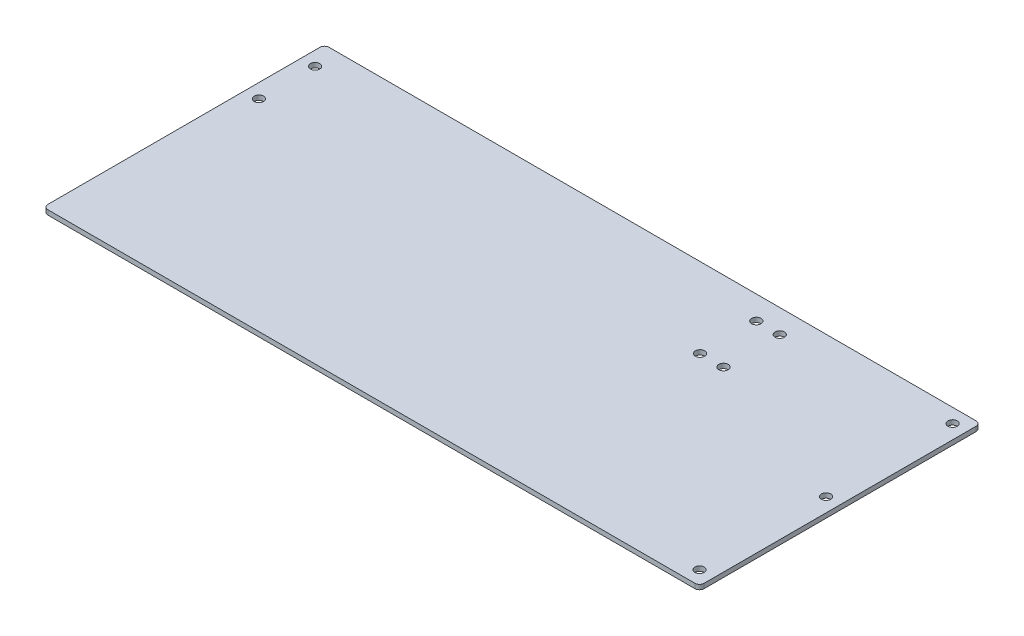
ISO-10303-21;
HEADER;
FILE_DESCRIPTION(('STEP AP214'),'2;1');
FILE_NAME('part.step','',(''),(''),'','','');
FILE_SCHEMA(('AUTOMOTIVE_DESIGN { 1 0 10303 214 1 1 1 1 }'));
ENDSEC;
DATA;
#1=APPLICATION_CONTEXT('core data for automotive mechanical design processes');
#2=APPLICATION_PROTOCOL_DEFINITION('international standard','automotive_design',2000,#1);
#3=PRODUCT_CONTEXT('',#1,'mechanical');
#4=PRODUCT('Part','Part','',(#3));
#5=PRODUCT_RELATED_PRODUCT_CATEGORY('part','',(#4));
#6=PRODUCT_DEFINITION_FORMATION('','',#4);
#7=PRODUCT_DEFINITION_CONTEXT('part definition',#1,'design');
#8=PRODUCT_DEFINITION('design','',#6,#7);
#9=PRODUCT_DEFINITION_SHAPE('','',#8);
#10=(LENGTH_UNIT() NAMED_UNIT(*) SI_UNIT(.MILLI.,.METRE.));
#11=(NAMED_UNIT(*) PLANE_ANGLE_UNIT() SI_UNIT($,.RADIAN.));
#12=(NAMED_UNIT(*) SI_UNIT($,.STERADIAN.) SOLID_ANGLE_UNIT());
#13=UNCERTAINTY_MEASURE_WITH_UNIT(LENGTH_MEASURE(1.E-05),#10,'distance_accuracy_value','');
#14=(GEOMETRIC_REPRESENTATION_CONTEXT(3) GLOBAL_UNCERTAINTY_ASSIGNED_CONTEXT((#13)) GLOBAL_UNIT_ASSIGNED_CONTEXT((#10,
#11,#12)) REPRESENTATION_CONTEXT('',''));
#15=CARTESIAN_POINT('',(0.,0.,0.));
#16=DIRECTION('',(0.,0.,1.));
#17=DIRECTION('',(1.,0.,0.));
#18=AXIS2_PLACEMENT_3D('',#15,#16,#17);
#19=CARTESIAN_POINT('',(222.25,3.175,-95.25));
#20=DIRECTION('',(-1.,0.,0.));
#21=DIRECTION('',(0.,0.,1.));
#22=AXIS2_PLACEMENT_3D('',#19,#20,#21);
#23=PLANE('',#22);
#24=DIRECTION('',(0.,0.,-1.));
#25=VECTOR('',#24,1.);
#26=CARTESIAN_POINT('',(222.25,0.,-95.25));
#27=LINE('',#26,#25);
#28=CARTESIAN_POINT('',(222.25,0.,92.075));
#29=VERTEX_POINT('',#28);
#30=CARTESIAN_POINT('',(222.25,0.,-92.075));
#31=VERTEX_POINT('',#30);
#32=EDGE_CURVE('E127',#29,#31,#27,.T.);
#33=ORIENTED_EDGE('',*,*,#32,.T.);
#34=DIRECTION('',(0.,-1.,0.));
#35=VECTOR('',#34,1.);
#36=CARTESIAN_POINT('',(222.25,3.175,-92.075));
#37=LINE('',#36,#35);
#38=CARTESIAN_POINT('',(222.25,3.175,-92.075));
#39=VERTEX_POINT('',#38);
#40=EDGE_CURVE('E105',#31,#39,#37,.F.);
#41=ORIENTED_EDGE('',*,*,#40,.T.);
#42=DIRECTION('',(0.,0.,-1.));
#43=VECTOR('',#42,1.);
#44=CARTESIAN_POINT('',(222.25,3.175,-95.25));
#45=LINE('',#44,#43);
#46=CARTESIAN_POINT('',(222.25,3.175,92.075));
#47=VERTEX_POINT('',#46);
#48=EDGE_CURVE('E137',#47,#39,#45,.T.);
#49=ORIENTED_EDGE('',*,*,#48,.F.);
#50=DIRECTION('',(0.,-1.,0.));
#51=VECTOR('',#50,1.);
#52=CARTESIAN_POINT('',(222.25,3.175,92.075));
#53=LINE('',#52,#51);
#54=EDGE_CURVE('E110',#47,#29,#53,.T.);
#55=ORIENTED_EDGE('',*,*,#54,.T.);
#56=EDGE_LOOP('',(#33,#41,#49,#55));
#57=FACE_BOUND('',#56,.T.);
#58=ADVANCED_FACE('F34',(#57),#23,.F.);
#59=CARTESIAN_POINT('',(-222.25,3.175,-95.25));
#60=DIRECTION('',(0.,0.,1.));
#61=DIRECTION('',(1.,0.,0.));
#62=AXIS2_PLACEMENT_3D('',#59,#60,#61);
#63=PLANE('',#62);
#64=DIRECTION('',(-1.,0.,0.));
#65=VECTOR('',#64,1.);
#66=CARTESIAN_POINT('',(-222.25,3.175,-95.25));
#67=LINE('',#66,#65);
#68=CARTESIAN_POINT('',(219.075,3.175,-95.25));
#69=VERTEX_POINT('',#68);
#70=CARTESIAN_POINT('',(-219.075,3.175,-95.25));
#71=VERTEX_POINT('',#70);
#72=EDGE_CURVE('E120',#69,#71,#67,.T.);
#73=ORIENTED_EDGE('',*,*,#72,.F.);
#74=DIRECTION('',(0.,-1.,0.));
#75=VECTOR('',#74,1.);
#76=CARTESIAN_POINT('',(219.075,3.175,-95.25));
#77=LINE('',#76,#75);
#78=CARTESIAN_POINT('',(219.075,0.,-95.25));
#79=VERTEX_POINT('',#78);
#80=EDGE_CURVE('E104',#69,#79,#77,.T.);
#81=ORIENTED_EDGE('',*,*,#80,.T.);
#82=DIRECTION('',(-1.,0.,0.));
#83=VECTOR('',#82,1.);
#84=CARTESIAN_POINT('',(-222.25,0.,-95.25));
#85=LINE('',#84,#83);
#86=CARTESIAN_POINT('',(-219.075,0.,-95.25));
#87=VERTEX_POINT('',#86);
#88=EDGE_CURVE('E117',#79,#87,#85,.T.);
#89=ORIENTED_EDGE('',*,*,#88,.T.);
#90=DIRECTION('',(0.,-1.,0.));
#91=VECTOR('',#90,1.);
#92=CARTESIAN_POINT('',(-219.075,3.175,-95.25));
#93=LINE('',#92,#91);
#94=EDGE_CURVE('E122',#87,#71,#93,.F.);
#95=ORIENTED_EDGE('',*,*,#94,.T.);
#96=EDGE_LOOP('',(#73,#81,#89,#95));
#97=FACE_BOUND('',#96,.T.);
#98=ADVANCED_FACE('F116',(#97),#63,.F.);
#99=CARTESIAN_POINT('',(-222.25,3.175,-95.25));
#100=DIRECTION('',(1.,0.,0.));
#101=DIRECTION('',(0.,0.,-1.));
#102=AXIS2_PLACEMENT_3D('',#99,#100,#101);
#103=PLANE('',#102);
#104=DIRECTION('',(0.,0.,1.));
#105=VECTOR('',#104,1.);
#106=CARTESIAN_POINT('',(-222.25,0.,-95.25));
#107=LINE('',#106,#105);
#108=CARTESIAN_POINT('',(-222.25,0.,-92.075));
#109=VERTEX_POINT('',#108);
#110=CARTESIAN_POINT('',(-222.25,0.,92.075));
#111=VERTEX_POINT('',#110);
#112=EDGE_CURVE('E126',#109,#111,#107,.T.);
#113=ORIENTED_EDGE('',*,*,#112,.T.);
#114=DIRECTION('',(0.,-1.,0.));
#115=VECTOR('',#114,1.);
#116=CARTESIAN_POINT('',(-222.25,3.175,92.075));
#117=LINE('',#116,#115);
#118=CARTESIAN_POINT('',(-222.25,3.175,92.075));
#119=VERTEX_POINT('',#118);
#120=EDGE_CURVE('E11',#111,#119,#117,.F.);
#121=ORIENTED_EDGE('',*,*,#120,.T.);
#122=DIRECTION('',(0.,0.,1.));
#123=VECTOR('',#122,1.);
#124=CARTESIAN_POINT('',(-222.25,3.175,-95.25));
#125=LINE('',#124,#123);
#126=CARTESIAN_POINT('',(-222.25,3.175,-92.075));
#127=VERTEX_POINT('',#126);
#128=EDGE_CURVE('E163',#127,#119,#125,.T.);
#129=ORIENTED_EDGE('',*,*,#128,.F.);
#130=DIRECTION('',(0.,-1.,0.));
#131=VECTOR('',#130,1.);
#132=CARTESIAN_POINT('',(-222.25,3.175,-92.075));
#133=LINE('',#132,#131);
#134=EDGE_CURVE('E42',#127,#109,#133,.T.);
#135=ORIENTED_EDGE('',*,*,#134,.T.);
#136=EDGE_LOOP('',(#113,#121,#129,#135));
#137=FACE_BOUND('',#136,.T.);
#138=ADVANCED_FACE('F161',(#137),#103,.F.);
#139=CARTESIAN_POINT('',(-222.25,3.175,95.25));
#140=DIRECTION('',(0.,0.,-1.));
#141=DIRECTION('',(-1.,0.,0.));
#142=AXIS2_PLACEMENT_3D('',#139,#140,#141);
#143=PLANE('',#142);
#144=DIRECTION('',(1.,0.,0.));
#145=VECTOR('',#144,1.);
#146=CARTESIAN_POINT('',(-222.25,0.,95.25));
#147=LINE('',#146,#145);
#148=CARTESIAN_POINT('',(-219.075,0.,95.25));
#149=VERTEX_POINT('',#148);
#150=CARTESIAN_POINT('',(219.075,0.,95.25));
#151=VERTEX_POINT('',#150);
#152=EDGE_CURVE('E130',#149,#151,#147,.T.);
#153=ORIENTED_EDGE('',*,*,#152,.T.);
#154=DIRECTION('',(0.,-1.,0.));
#155=VECTOR('',#154,1.);
#156=CARTESIAN_POINT('',(219.075,3.175,95.25));
#157=LINE('',#156,#155);
#158=CARTESIAN_POINT('',(219.075,3.175,95.25));
#159=VERTEX_POINT('',#158);
#160=EDGE_CURVE('E49',#151,#159,#157,.F.);
#161=ORIENTED_EDGE('',*,*,#160,.T.);
#162=DIRECTION('',(1.,0.,0.));
#163=VECTOR('',#162,1.);
#164=CARTESIAN_POINT('',(-222.25,3.175,95.25));
#165=LINE('',#164,#163);
#166=CARTESIAN_POINT('',(-219.075,3.175,95.25));
#167=VERTEX_POINT('',#166);
#168=EDGE_CURVE('E138',#167,#159,#165,.T.);
#169=ORIENTED_EDGE('',*,*,#168,.F.);
#170=DIRECTION('',(0.,-1.,0.));
#171=VECTOR('',#170,1.);
#172=CARTESIAN_POINT('',(-219.075,3.175,95.25));
#173=LINE('',#172,#171);
#174=EDGE_CURVE('E154',#167,#149,#173,.T.);
#175=ORIENTED_EDGE('',*,*,#174,.T.);
#176=EDGE_LOOP('',(#153,#161,#169,#175));
#177=FACE_BOUND('',#176,.T.);
#178=ADVANCED_FACE('F170',(#177),#143,.F.);
#179=CARTESIAN_POINT('',(0.,3.175,0.));
#180=DIRECTION('',(0.,1.,0.));
#181=DIRECTION('',(0.,0.,1.));
#182=AXIS2_PLACEMENT_3D('',#179,#180,#181);
#183=PLANE('',#182);
#184=CARTESIAN_POINT('',(212.725,3.175,-85.725));
#185=DIRECTION('',(0.,-1.,0.));
#186=DIRECTION('',(0.,0.,-1.));
#187=AXIS2_PLACEMENT_3D('',#184,#185,#186);
#188=CIRCLE('',#187,3.17500000000001);
#189=CARTESIAN_POINT('',(212.725,3.175,-88.9));
#190=VERTEX_POINT('',#189);
#191=EDGE_CURVE('E224',#190,#190,#188,.T.);
#192=ORIENTED_EDGE('',*,*,#191,.T.);
#193=EDGE_LOOP('',(#192));
#194=FACE_BOUND('',#193,.T.);
#195=CARTESIAN_POINT('',(212.725,3.175,0.));
#196=DIRECTION('',(0.,-1.,0.));
#197=DIRECTION('',(0.,0.,-1.));
#198=AXIS2_PLACEMENT_3D('',#195,#196,#197);
#199=CIRCLE('',#198,3.17500000000001);
#200=CARTESIAN_POINT('',(212.725,3.175,-3.17500000000001));
#201=VERTEX_POINT('',#200);
#202=EDGE_CURVE('E218',#201,#201,#199,.T.);
#203=ORIENTED_EDGE('',*,*,#202,.T.);
#204=EDGE_LOOP('',(#203));
#205=FACE_BOUND('',#204,.T.);
#206=CARTESIAN_POINT('',(212.725,3.175,85.725));
#207=DIRECTION('',(0.,-1.,0.));
#208=DIRECTION('',(0.,0.,-1.));
#209=AXIS2_PLACEMENT_3D('',#206,#207,#208);
#210=CIRCLE('',#209,3.17500000000001);
#211=CARTESIAN_POINT('',(212.725,3.175,82.55));
#212=VERTEX_POINT('',#211);
#213=EDGE_CURVE('E212',#212,#212,#210,.T.);
#214=ORIENTED_EDGE('',*,*,#213,.T.);
#215=EDGE_LOOP('',(#214));
#216=FACE_BOUND('',#215,.T.);
#217=CARTESIAN_POINT('',(-212.725,3.175,-79.375));
#218=DIRECTION('',(0.,1.,0.));
#219=DIRECTION('',(0.,0.,1.));
#220=AXIS2_PLACEMENT_3D('',#217,#218,#219);
#221=CIRCLE('',#220,3.17500000000001);
#222=CARTESIAN_POINT('',(-212.725,3.175,-76.2));
#223=VERTEX_POINT('',#222);
#224=EDGE_CURVE('E209',#223,#223,#221,.T.);
#225=ORIENTED_EDGE('',*,*,#224,.F.);
#226=EDGE_LOOP('',(#225));
#227=FACE_BOUND('',#226,.T.);
#228=CARTESIAN_POINT('',(-212.725,3.175,-41.275));
#229=DIRECTION('',(0.,1.,0.));
#230=DIRECTION('',(0.,0.,1.));
#231=AXIS2_PLACEMENT_3D('',#228,#229,#230);
#232=CIRCLE('',#231,3.17500000000001);
#233=CARTESIAN_POINT('',(-212.725,3.175,-38.1));
#234=VERTEX_POINT('',#233);
#235=EDGE_CURVE('E203',#234,#234,#232,.T.);
#236=ORIENTED_EDGE('',*,*,#235,.F.);
#237=EDGE_LOOP('',(#236));
#238=FACE_BOUND('',#237,.T.);
#239=CARTESIAN_POINT('',(101.981,3.175,-79.375));
#240=DIRECTION('',(0.,1.,0.));
#241=DIRECTION('',(0.,0.,1.));
#242=AXIS2_PLACEMENT_3D('',#239,#240,#241);
#243=CIRCLE('',#242,3.175);
#244=CARTESIAN_POINT('',(101.981,3.175,-76.2));
#245=VERTEX_POINT('',#244);
#246=EDGE_CURVE('E197',#245,#245,#243,.T.);
#247=ORIENTED_EDGE('',*,*,#246,.F.);
#248=EDGE_LOOP('',(#247));
#249=FACE_BOUND('',#248,.T.);
#250=CARTESIAN_POINT('',(101.981,3.175,-41.275));
#251=DIRECTION('',(0.,1.,0.));
#252=DIRECTION('',(0.,0.,1.));
#253=AXIS2_PLACEMENT_3D('',#250,#251,#252);
#254=CIRCLE('',#253,3.175);
#255=CARTESIAN_POINT('',(101.981,3.175,-38.1));
#256=VERTEX_POINT('',#255);
#257=EDGE_CURVE('E191',#256,#256,#254,.T.);
#258=ORIENTED_EDGE('',*,*,#257,.F.);
#259=EDGE_LOOP('',(#258));
#260=FACE_BOUND('',#259,.T.);
#261=CARTESIAN_POINT('',(86.106,3.175,-79.375));
#262=DIRECTION('',(0.,1.,0.));
#263=DIRECTION('',(0.,0.,1.));
#264=AXIS2_PLACEMENT_3D('',#261,#262,#263);
#265=CIRCLE('',#264,3.175);
#266=CARTESIAN_POINT('',(86.106,3.175,-76.2));
#267=VERTEX_POINT('',#266);
#268=EDGE_CURVE('E185',#267,#267,#265,.T.);
#269=ORIENTED_EDGE('',*,*,#268,.F.);
#270=EDGE_LOOP('',(#269));
#271=FACE_BOUND('',#270,.T.);
#272=CARTESIAN_POINT('',(86.106,3.175,-41.275));
#273=DIRECTION('',(0.,1.,0.));
#274=DIRECTION('',(0.,0.,1.));
#275=AXIS2_PLACEMENT_3D('',#272,#273,#274);
#276=CIRCLE('',#275,3.175);
#277=CARTESIAN_POINT('',(86.106,3.175,-38.1));
#278=VERTEX_POINT('',#277);
#279=EDGE_CURVE('E179',#278,#278,#276,.T.);
#280=ORIENTED_EDGE('',*,*,#279,.F.);
#281=EDGE_LOOP('',(#280));
#282=FACE_BOUND('',#281,.T.);
#283=ORIENTED_EDGE('',*,*,#48,.T.);
#284=CARTESIAN_POINT('',(219.075,3.175,-92.075));
#285=DIRECTION('',(0.,1.,0.));
#286=DIRECTION('',(0.,0.,1.));
#287=AXIS2_PLACEMENT_3D('',#284,#285,#286);
#288=CIRCLE('',#287,3.175);
#289=EDGE_CURVE('E152',#39,#69,#288,.T.);
#290=ORIENTED_EDGE('',*,*,#289,.T.);
#291=ORIENTED_EDGE('',*,*,#72,.T.);
#292=CARTESIAN_POINT('',(-219.075,3.175,-92.075));
#293=DIRECTION('',(0.,1.,0.));
#294=DIRECTION('',(0.,0.,1.));
#295=AXIS2_PLACEMENT_3D('',#292,#293,#294);
#296=CIRCLE('',#295,3.175);
#297=EDGE_CURVE('E147',#71,#127,#296,.T.);
#298=ORIENTED_EDGE('',*,*,#297,.T.);
#299=ORIENTED_EDGE('',*,*,#128,.T.);
#300=CARTESIAN_POINT('',(-219.075,3.175,92.075));
#301=DIRECTION('',(0.,1.,0.));
#302=DIRECTION('',(0.,0.,1.));
#303=AXIS2_PLACEMENT_3D('',#300,#301,#302);
#304=CIRCLE('',#303,3.175);
#305=EDGE_CURVE('E56',#119,#167,#304,.T.);
#306=ORIENTED_EDGE('',*,*,#305,.T.);
#307=ORIENTED_EDGE('',*,*,#168,.T.);
#308=CARTESIAN_POINT('',(219.075,3.175,92.075));
#309=DIRECTION('',(0.,1.,0.));
#310=DIRECTION('',(0.,0.,1.));
#311=AXIS2_PLACEMENT_3D('',#308,#309,#310);
#312=CIRCLE('',#311,3.175);
#313=EDGE_CURVE('E150',#159,#47,#312,.T.);
#314=ORIENTED_EDGE('',*,*,#313,.T.);
#315=EDGE_LOOP('',(#283,#290,#291,#298,#299,#306,#307,#314));
#316=FACE_BOUND('',#315,.T.);
#317=ADVANCED_FACE('F236',(#194,#205,#216,#227,#238,#249,#260,#271,#282,#316),#183,.T.);
#318=CARTESIAN_POINT('',(0.,0.,0.));
#319=DIRECTION('',(0.,1.,0.));
#320=DIRECTION('',(0.,0.,1.));
#321=AXIS2_PLACEMENT_3D('',#318,#319,#320);
#322=PLANE('',#321);
#323=CARTESIAN_POINT('',(212.725,0.,-85.725));
#324=DIRECTION('',(0.,-1.,0.));
#325=DIRECTION('',(0.,0.,-1.));
#326=AXIS2_PLACEMENT_3D('',#323,#324,#325);
#327=CIRCLE('',#326,3.17499999999998);
#328=CARTESIAN_POINT('',(212.725,0.,-88.9));
#329=VERTEX_POINT('',#328);
#330=EDGE_CURVE('E227',#329,#329,#327,.T.);
#331=ORIENTED_EDGE('',*,*,#330,.F.);
#332=EDGE_LOOP('',(#331));
#333=FACE_BOUND('',#332,.T.);
#334=CARTESIAN_POINT('',(212.725,0.,0.));
#335=DIRECTION('',(0.,-1.,0.));
#336=DIRECTION('',(0.,0.,-1.));
#337=AXIS2_PLACEMENT_3D('',#334,#335,#336);
#338=CIRCLE('',#337,3.17499999999998);
#339=CARTESIAN_POINT('',(212.725,0.,-3.17499999999998));
#340=VERTEX_POINT('',#339);
#341=EDGE_CURVE('E221',#340,#340,#338,.T.);
#342=ORIENTED_EDGE('',*,*,#341,.F.);
#343=EDGE_LOOP('',(#342));
#344=FACE_BOUND('',#343,.T.);
#345=CARTESIAN_POINT('',(212.725,0.,85.725));
#346=DIRECTION('',(0.,-1.,0.));
#347=DIRECTION('',(0.,0.,-1.));
#348=AXIS2_PLACEMENT_3D('',#345,#346,#347);
#349=CIRCLE('',#348,3.17499999999998);
#350=CARTESIAN_POINT('',(212.725,0.,82.55));
#351=VERTEX_POINT('',#350);
#352=EDGE_CURVE('E215',#351,#351,#349,.T.);
#353=ORIENTED_EDGE('',*,*,#352,.F.);
#354=EDGE_LOOP('',(#353));
#355=FACE_BOUND('',#354,.T.);
#356=CARTESIAN_POINT('',(-212.725,0.,-79.375));
#357=DIRECTION('',(0.,1.,0.));
#358=DIRECTION('',(0.,0.,1.));
#359=AXIS2_PLACEMENT_3D('',#356,#357,#358);
#360=CIRCLE('',#359,3.17500000000001);
#361=CARTESIAN_POINT('',(-212.725,0.,-76.2));
#362=VERTEX_POINT('',#361);
#363=EDGE_CURVE('E206',#362,#362,#360,.T.);
#364=ORIENTED_EDGE('',*,*,#363,.T.);
#365=EDGE_LOOP('',(#364));
#366=FACE_BOUND('',#365,.T.);
#367=CARTESIAN_POINT('',(-212.725,0.,-41.275));
#368=DIRECTION('',(0.,1.,0.));
#369=DIRECTION('',(0.,0.,1.));
#370=AXIS2_PLACEMENT_3D('',#367,#368,#369);
#371=CIRCLE('',#370,3.17500000000001);
#372=CARTESIAN_POINT('',(-212.725,0.,-38.1));
#373=VERTEX_POINT('',#372);
#374=EDGE_CURVE('E200',#373,#373,#371,.T.);
#375=ORIENTED_EDGE('',*,*,#374,.T.);
#376=EDGE_LOOP('',(#375));
#377=FACE_BOUND('',#376,.T.);
#378=CARTESIAN_POINT('',(101.981,0.,-79.375));
#379=DIRECTION('',(0.,1.,0.));
#380=DIRECTION('',(0.,0.,1.));
#381=AXIS2_PLACEMENT_3D('',#378,#379,#380);
#382=CIRCLE('',#381,3.175);
#383=CARTESIAN_POINT('',(101.981,0.,-76.2));
#384=VERTEX_POINT('',#383);
#385=EDGE_CURVE('E194',#384,#384,#382,.T.);
#386=ORIENTED_EDGE('',*,*,#385,.T.);
#387=EDGE_LOOP('',(#386));
#388=FACE_BOUND('',#387,.T.);
#389=CARTESIAN_POINT('',(101.981,0.,-41.275));
#390=DIRECTION('',(0.,1.,0.));
#391=DIRECTION('',(0.,0.,1.));
#392=AXIS2_PLACEMENT_3D('',#389,#390,#391);
#393=CIRCLE('',#392,3.175);
#394=CARTESIAN_POINT('',(101.981,0.,-38.1));
#395=VERTEX_POINT('',#394);
#396=EDGE_CURVE('E188',#395,#395,#393,.T.);
#397=ORIENTED_EDGE('',*,*,#396,.T.);
#398=EDGE_LOOP('',(#397));
#399=FACE_BOUND('',#398,.T.);
#400=CARTESIAN_POINT('',(86.106,0.,-79.375));
#401=DIRECTION('',(0.,1.,0.));
#402=DIRECTION('',(0.,0.,1.));
#403=AXIS2_PLACEMENT_3D('',#400,#401,#402);
#404=CIRCLE('',#403,3.175);
#405=CARTESIAN_POINT('',(86.106,0.,-76.2));
#406=VERTEX_POINT('',#405);
#407=EDGE_CURVE('E182',#406,#406,#404,.T.);
#408=ORIENTED_EDGE('',*,*,#407,.T.);
#409=EDGE_LOOP('',(#408));
#410=FACE_BOUND('',#409,.T.);
#411=CARTESIAN_POINT('',(86.106,0.,-41.275));
#412=DIRECTION('',(0.,1.,0.));
#413=DIRECTION('',(0.,0.,1.));
#414=AXIS2_PLACEMENT_3D('',#411,#412,#413);
#415=CIRCLE('',#414,3.175);
#416=CARTESIAN_POINT('',(86.106,0.,-38.1));
#417=VERTEX_POINT('',#416);
#418=EDGE_CURVE('E132',#417,#417,#415,.T.);
#419=ORIENTED_EDGE('',*,*,#418,.T.);
#420=EDGE_LOOP('',(#419));
#421=FACE_BOUND('',#420,.T.);
#422=ORIENTED_EDGE('',*,*,#88,.F.);
#423=CARTESIAN_POINT('',(219.075,0.,-92.075));
#424=DIRECTION('',(0.,1.,0.));
#425=DIRECTION('',(0.,0.,1.));
#426=AXIS2_PLACEMENT_3D('',#423,#424,#425);
#427=CIRCLE('',#426,3.175);
#428=EDGE_CURVE('E100',#79,#31,#427,.F.);
#429=ORIENTED_EDGE('',*,*,#428,.T.);
#430=ORIENTED_EDGE('',*,*,#32,.F.);
#431=CARTESIAN_POINT('',(219.075,0.,92.075));
#432=DIRECTION('',(0.,1.,0.));
#433=DIRECTION('',(0.,0.,1.));
#434=AXIS2_PLACEMENT_3D('',#431,#432,#433);
#435=CIRCLE('',#434,3.175);
#436=EDGE_CURVE('E111',#29,#151,#435,.F.);
#437=ORIENTED_EDGE('',*,*,#436,.T.);
#438=ORIENTED_EDGE('',*,*,#152,.F.);
#439=CARTESIAN_POINT('',(-219.075,0.,92.075));
#440=DIRECTION('',(0.,1.,0.));
#441=DIRECTION('',(0.,0.,1.));
#442=AXIS2_PLACEMENT_3D('',#439,#440,#441);
#443=CIRCLE('',#442,3.175);
#444=EDGE_CURVE('E141',#149,#111,#443,.F.);
#445=ORIENTED_EDGE('',*,*,#444,.T.);
#446=ORIENTED_EDGE('',*,*,#112,.F.);
#447=CARTESIAN_POINT('',(-219.075,0.,-92.075));
#448=DIRECTION('',(0.,1.,0.));
#449=DIRECTION('',(0.,0.,1.));
#450=AXIS2_PLACEMENT_3D('',#447,#448,#449);
#451=CIRCLE('',#450,3.175);
#452=EDGE_CURVE('E121',#109,#87,#451,.F.);
#453=ORIENTED_EDGE('',*,*,#452,.T.);
#454=EDGE_LOOP('',(#422,#429,#430,#437,#438,#445,#446,#453));
#455=FACE_BOUND('',#454,.T.);
#456=ADVANCED_FACE('F124',(#333,#344,#355,#366,#377,#388,#399,#410,#421,#455),#322,.F.);
#457=CARTESIAN_POINT('',(86.106,3.175,-41.275));
#458=DIRECTION('',(0.,1.,0.));
#459=DIRECTION('',(0.,0.,1.));
#460=AXIS2_PLACEMENT_3D('',#457,#458,#459);
#461=CYLINDRICAL_SURFACE('',#460,3.175);
#462=ORIENTED_EDGE('',*,*,#418,.F.);
#463=EDGE_LOOP('',(#462));
#464=FACE_BOUND('',#463,.T.);
#465=ORIENTED_EDGE('',*,*,#279,.T.);
#466=EDGE_LOOP('',(#465));
#467=FACE_BOUND('',#466,.T.);
#468=ADVANCED_FACE('F235',(#464,#467),#461,.F.);
#469=CARTESIAN_POINT('',(86.106,3.175,-79.375));
#470=DIRECTION('',(0.,1.,0.));
#471=DIRECTION('',(0.,0.,1.));
#472=AXIS2_PLACEMENT_3D('',#469,#470,#471);
#473=CYLINDRICAL_SURFACE('',#472,3.175);
#474=ORIENTED_EDGE('',*,*,#407,.F.);
#475=EDGE_LOOP('',(#474));
#476=FACE_BOUND('',#475,.T.);
#477=ORIENTED_EDGE('',*,*,#268,.T.);
#478=EDGE_LOOP('',(#477));
#479=FACE_BOUND('',#478,.T.);
#480=ADVANCED_FACE('F256',(#476,#479),#473,.F.);
#481=CARTESIAN_POINT('',(101.981,3.175,-41.275));
#482=DIRECTION('',(0.,1.,0.));
#483=DIRECTION('',(0.,0.,1.));
#484=AXIS2_PLACEMENT_3D('',#481,#482,#483);
#485=CYLINDRICAL_SURFACE('',#484,3.175);
#486=ORIENTED_EDGE('',*,*,#396,.F.);
#487=EDGE_LOOP('',(#486));
#488=FACE_BOUND('',#487,.T.);
#489=ORIENTED_EDGE('',*,*,#257,.T.);
#490=EDGE_LOOP('',(#489));
#491=FACE_BOUND('',#490,.T.);
#492=ADVANCED_FACE('F289',(#488,#491),#485,.F.);
#493=CARTESIAN_POINT('',(101.981,3.175,-79.375));
#494=DIRECTION('',(0.,1.,0.));
#495=DIRECTION('',(0.,0.,1.));
#496=AXIS2_PLACEMENT_3D('',#493,#494,#495);
#497=CYLINDRICAL_SURFACE('',#496,3.175);
#498=ORIENTED_EDGE('',*,*,#385,.F.);
#499=EDGE_LOOP('',(#498));
#500=FACE_BOUND('',#499,.T.);
#501=ORIENTED_EDGE('',*,*,#246,.T.);
#502=EDGE_LOOP('',(#501));
#503=FACE_BOUND('',#502,.T.);
#504=ADVANCED_FACE('F293',(#500,#503),#497,.F.);
#505=CARTESIAN_POINT('',(-212.725,3.175,-41.275));
#506=DIRECTION('',(0.,1.,0.));
#507=DIRECTION('',(0.,0.,1.));
#508=AXIS2_PLACEMENT_3D('',#505,#506,#507);
#509=CYLINDRICAL_SURFACE('',#508,3.17500000000001);
#510=ORIENTED_EDGE('',*,*,#374,.F.);
#511=EDGE_LOOP('',(#510));
#512=FACE_BOUND('',#511,.T.);
#513=ORIENTED_EDGE('',*,*,#235,.T.);
#514=EDGE_LOOP('',(#513));
#515=FACE_BOUND('',#514,.T.);
#516=ADVANCED_FACE('F297',(#512,#515),#509,.F.);
#517=CARTESIAN_POINT('',(-212.725,3.175,-79.375));
#518=DIRECTION('',(0.,1.,0.));
#519=DIRECTION('',(0.,0.,1.));
#520=AXIS2_PLACEMENT_3D('',#517,#518,#519);
#521=CYLINDRICAL_SURFACE('',#520,3.17500000000001);
#522=ORIENTED_EDGE('',*,*,#363,.F.);
#523=EDGE_LOOP('',(#522));
#524=FACE_BOUND('',#523,.T.);
#525=ORIENTED_EDGE('',*,*,#224,.T.);
#526=EDGE_LOOP('',(#525));
#527=FACE_BOUND('',#526,.T.);
#528=ADVANCED_FACE('F274',(#524,#527),#521,.F.);
#529=CARTESIAN_POINT('',(219.075,3.175,-92.075));
#530=DIRECTION('',(0.,-1.,0.));
#531=DIRECTION('',(0.,0.,-1.));
#532=AXIS2_PLACEMENT_3D('',#529,#530,#531);
#533=CYLINDRICAL_SURFACE('',#532,3.175);
#534=ORIENTED_EDGE('',*,*,#289,.F.);
#535=ORIENTED_EDGE('',*,*,#40,.F.);
#536=ORIENTED_EDGE('',*,*,#428,.F.);
#537=ORIENTED_EDGE('',*,*,#80,.F.);
#538=EDGE_LOOP('',(#534,#535,#536,#537));
#539=FACE_BOUND('',#538,.T.);
#540=ADVANCED_FACE('F103',(#539),#533,.T.);
#541=CARTESIAN_POINT('',(219.075,3.175,92.075));
#542=DIRECTION('',(0.,-1.,0.));
#543=DIRECTION('',(0.,0.,-1.));
#544=AXIS2_PLACEMENT_3D('',#541,#542,#543);
#545=CYLINDRICAL_SURFACE('',#544,3.175);
#546=ORIENTED_EDGE('',*,*,#313,.F.);
#547=ORIENTED_EDGE('',*,*,#160,.F.);
#548=ORIENTED_EDGE('',*,*,#436,.F.);
#549=ORIENTED_EDGE('',*,*,#54,.F.);
#550=EDGE_LOOP('',(#546,#547,#548,#549));
#551=FACE_BOUND('',#550,.T.);
#552=ADVANCED_FACE('F267',(#551),#545,.T.);
#553=CARTESIAN_POINT('',(-219.075,3.175,92.075));
#554=DIRECTION('',(0.,-1.,0.));
#555=DIRECTION('',(0.,0.,-1.));
#556=AXIS2_PLACEMENT_3D('',#553,#554,#555);
#557=CYLINDRICAL_SURFACE('',#556,3.175);
#558=ORIENTED_EDGE('',*,*,#305,.F.);
#559=ORIENTED_EDGE('',*,*,#120,.F.);
#560=ORIENTED_EDGE('',*,*,#444,.F.);
#561=ORIENTED_EDGE('',*,*,#174,.F.);
#562=EDGE_LOOP('',(#558,#559,#560,#561));
#563=FACE_BOUND('',#562,.T.);
#564=ADVANCED_FACE('F169',(#563),#557,.T.);
#565=CARTESIAN_POINT('',(-219.075,3.175,-92.075));
#566=DIRECTION('',(0.,-1.,0.));
#567=DIRECTION('',(0.,0.,-1.));
#568=AXIS2_PLACEMENT_3D('',#565,#566,#567);
#569=CYLINDRICAL_SURFACE('',#568,3.175);
#570=ORIENTED_EDGE('',*,*,#297,.F.);
#571=ORIENTED_EDGE('',*,*,#94,.F.);
#572=ORIENTED_EDGE('',*,*,#452,.F.);
#573=ORIENTED_EDGE('',*,*,#134,.F.);
#574=EDGE_LOOP('',(#570,#571,#572,#573));
#575=FACE_BOUND('',#574,.T.);
#576=ADVANCED_FACE('F36',(#575),#569,.T.);
#577=CARTESIAN_POINT('',(212.725,0.,85.725));
#578=DIRECTION('',(0.,-1.,0.));
#579=DIRECTION('',(0.,0.,-1.));
#580=AXIS2_PLACEMENT_3D('',#577,#578,#579);
#581=CYLINDRICAL_SURFACE('',#580,3.175);
#582=ORIENTED_EDGE('',*,*,#213,.F.);
#583=EDGE_LOOP('',(#582));
#584=FACE_BOUND('',#583,.T.);
#585=ORIENTED_EDGE('',*,*,#352,.T.);
#586=EDGE_LOOP('',(#585));
#587=FACE_BOUND('',#586,.T.);
#588=ADVANCED_FACE('F305',(#584,#587),#581,.F.);
#589=CARTESIAN_POINT('',(212.725,0.,0.));
#590=DIRECTION('',(0.,-1.,0.));
#591=DIRECTION('',(0.,0.,-1.));
#592=AXIS2_PLACEMENT_3D('',#589,#590,#591);
#593=CYLINDRICAL_SURFACE('',#592,3.175);
#594=ORIENTED_EDGE('',*,*,#202,.F.);
#595=EDGE_LOOP('',(#594));
#596=FACE_BOUND('',#595,.T.);
#597=ORIENTED_EDGE('',*,*,#341,.T.);
#598=EDGE_LOOP('',(#597));
#599=FACE_BOUND('',#598,.T.);
#600=ADVANCED_FACE('F308',(#596,#599),#593,.F.);
#601=CARTESIAN_POINT('',(212.725,0.,-85.725));
#602=DIRECTION('',(0.,-1.,0.));
#603=DIRECTION('',(0.,0.,-1.));
#604=AXIS2_PLACEMENT_3D('',#601,#602,#603);
#605=CYLINDRICAL_SURFACE('',#604,3.175);
#606=ORIENTED_EDGE('',*,*,#191,.F.);
#607=EDGE_LOOP('',(#606));
#608=FACE_BOUND('',#607,.T.);
#609=ORIENTED_EDGE('',*,*,#330,.T.);
#610=EDGE_LOOP('',(#609));
#611=FACE_BOUND('',#610,.T.);
#612=ADVANCED_FACE('F231',(#608,#611),#605,.F.);
#613=CLOSED_SHELL('',(#58,#98,#138,#178,#317,#456,#468,#480,#492,#504,#516,#528,#540,#552,#564,
#576,#588,#600,#612));
#614=MANIFOLD_SOLID_BREP('B2',#613);
#615=ADVANCED_BREP_SHAPE_REPRESENTATION('',(#18,#614),#14);
#616=SHAPE_DEFINITION_REPRESENTATION(#9,#615);
ENDSEC;
END-ISO-10303-21;
